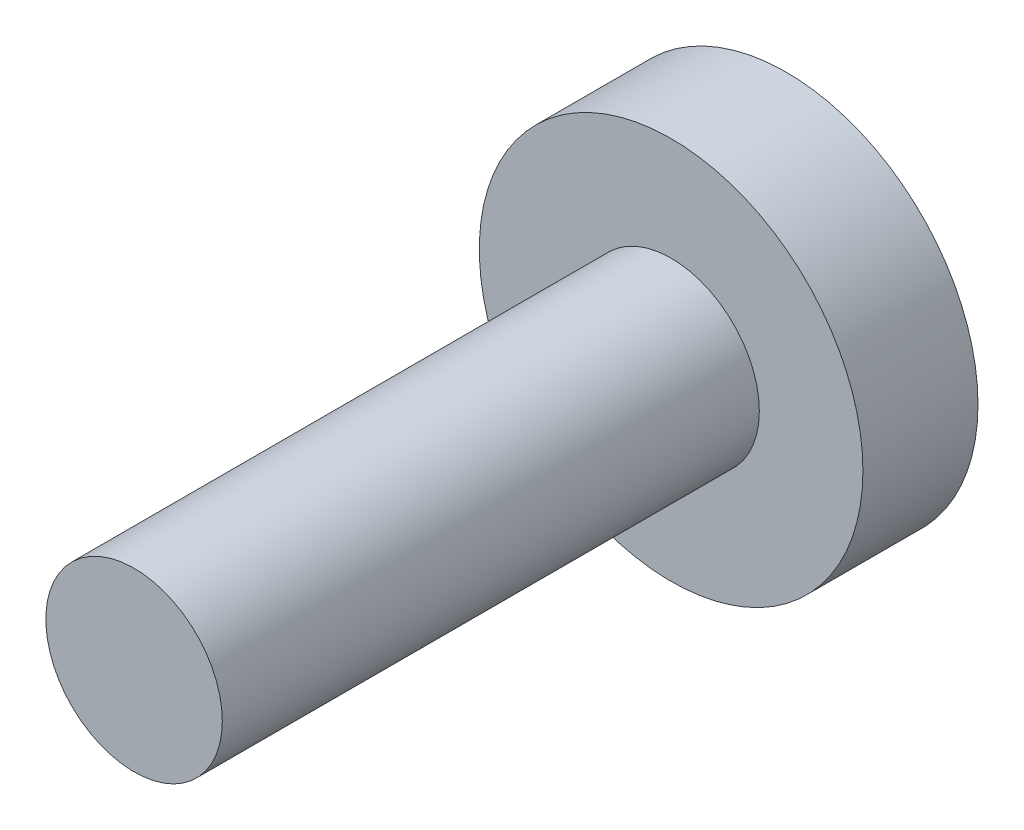
ISO-10303-21;
HEADER;
FILE_DESCRIPTION(('STEP AP214'),'2;1');
FILE_NAME('part.step','',(''),(''),'','','');
FILE_SCHEMA(('AUTOMOTIVE_DESIGN { 1 0 10303 214 1 1 1 1 }'));
ENDSEC;
DATA;
#1=APPLICATION_CONTEXT('core data for automotive mechanical design processes');
#2=APPLICATION_PROTOCOL_DEFINITION('international standard','automotive_design',2000,#1);
#3=PRODUCT_CONTEXT('',#1,'mechanical');
#4=PRODUCT('Part','Part','',(#3));
#5=PRODUCT_RELATED_PRODUCT_CATEGORY('part','',(#4));
#6=PRODUCT_DEFINITION_FORMATION('','',#4);
#7=PRODUCT_DEFINITION_CONTEXT('part definition',#1,'design');
#8=PRODUCT_DEFINITION('design','',#6,#7);
#9=PRODUCT_DEFINITION_SHAPE('','',#8);
#10=(LENGTH_UNIT() NAMED_UNIT(*) SI_UNIT(.MILLI.,.METRE.));
#11=(NAMED_UNIT(*) PLANE_ANGLE_UNIT() SI_UNIT($,.RADIAN.));
#12=(NAMED_UNIT(*) SI_UNIT($,.STERADIAN.) SOLID_ANGLE_UNIT());
#13=UNCERTAINTY_MEASURE_WITH_UNIT(LENGTH_MEASURE(1.E-05),#10,'distance_accuracy_value','');
#14=(GEOMETRIC_REPRESENTATION_CONTEXT(3) GLOBAL_UNCERTAINTY_ASSIGNED_CONTEXT((#13)) GLOBAL_UNIT_ASSIGNED_CONTEXT((#10,
#11,#12)) REPRESENTATION_CONTEXT('',''));
#15=CARTESIAN_POINT('',(0.,0.,0.));
#16=DIRECTION('',(0.,0.,1.));
#17=DIRECTION('',(1.,0.,0.));
#18=AXIS2_PLACEMENT_3D('',#15,#16,#17);
#19=CARTESIAN_POINT('',(0.,0.,17.78));
#20=DIRECTION('',(0.,0.,-1.));
#21=DIRECTION('',(-1.,0.,0.));
#22=AXIS2_PLACEMENT_3D('',#19,#20,#21);
#23=CYLINDRICAL_SURFACE('',#22,2.921);
#24=CARTESIAN_POINT('',(0.,0.,17.78));
#25=DIRECTION('',(0.,0.,1.));
#26=DIRECTION('',(1.,0.,0.));
#27=AXIS2_PLACEMENT_3D('',#24,#25,#26);
#28=CIRCLE('',#27,2.921);
#29=CARTESIAN_POINT('',(2.921,0.,17.78));
#30=VERTEX_POINT('',#29);
#31=EDGE_CURVE('E10',#30,#30,#28,.T.);
#32=ORIENTED_EDGE('',*,*,#31,.F.);
#33=EDGE_LOOP('',(#32));
#34=FACE_BOUND('',#33,.T.);
#35=CARTESIAN_POINT('',(0.,0.,0.));
#36=DIRECTION('',(0.,0.,1.));
#37=DIRECTION('',(1.,0.,0.));
#38=AXIS2_PLACEMENT_3D('',#35,#36,#37);
#39=CIRCLE('',#38,2.921);
#40=CARTESIAN_POINT('',(2.921,0.,0.));
#41=VERTEX_POINT('',#40);
#42=EDGE_CURVE('E34',#41,#41,#39,.T.);
#43=ORIENTED_EDGE('',*,*,#42,.T.);
#44=EDGE_LOOP('',(#43));
#45=FACE_BOUND('',#44,.T.);
#46=ADVANCED_FACE('F31',(#34,#45),#23,.T.);
#47=CARTESIAN_POINT('',(0.,0.,17.78));
#48=DIRECTION('',(0.,0.,1.));
#49=DIRECTION('',(1.,0.,0.));
#50=AXIS2_PLACEMENT_3D('',#47,#48,#49);
#51=PLANE('',#50);
#52=ORIENTED_EDGE('',*,*,#31,.T.);
#53=EDGE_LOOP('',(#52));
#54=FACE_BOUND('',#53,.T.);
#55=ADVANCED_FACE('F62',(#54),#51,.T.);
#56=CARTESIAN_POINT('',(0.,0.,-3.81));
#57=DIRECTION('',(0.,0.,1.));
#58=DIRECTION('',(1.,0.,0.));
#59=AXIS2_PLACEMENT_3D('',#56,#57,#58);
#60=CYLINDRICAL_SURFACE('',#59,6.35);
#61=CARTESIAN_POINT('',(0.,0.,-3.81));
#62=DIRECTION('',(0.,0.,1.));
#63=DIRECTION('',(1.,0.,0.));
#64=AXIS2_PLACEMENT_3D('',#61,#62,#63);
#65=CIRCLE('',#64,6.35);
#66=CARTESIAN_POINT('',(6.35,0.,-3.81));
#67=VERTEX_POINT('',#66);
#68=EDGE_CURVE('E41',#67,#67,#65,.T.);
#69=ORIENTED_EDGE('',*,*,#68,.T.);
#70=EDGE_LOOP('',(#69));
#71=FACE_BOUND('',#70,.T.);
#72=CARTESIAN_POINT('',(0.,0.,0.));
#73=DIRECTION('',(0.,0.,1.));
#74=DIRECTION('',(1.,0.,0.));
#75=AXIS2_PLACEMENT_3D('',#72,#73,#74);
#76=CIRCLE('',#75,6.35);
#77=CARTESIAN_POINT('',(6.35,0.,0.));
#78=VERTEX_POINT('',#77);
#79=EDGE_CURVE('E43',#78,#78,#76,.T.);
#80=ORIENTED_EDGE('',*,*,#79,.F.);
#81=EDGE_LOOP('',(#80));
#82=FACE_BOUND('',#81,.T.);
#83=ADVANCED_FACE('F49',(#71,#82),#60,.T.);
#84=CARTESIAN_POINT('',(0.,0.,-3.81));
#85=DIRECTION('',(0.,0.,1.));
#86=DIRECTION('',(1.,0.,0.));
#87=AXIS2_PLACEMENT_3D('',#84,#85,#86);
#88=PLANE('',#87);
#89=ORIENTED_EDGE('',*,*,#68,.F.);
#90=EDGE_LOOP('',(#89));
#91=FACE_BOUND('',#90,.T.);
#92=ADVANCED_FACE('F52',(#91),#88,.F.);
#93=CARTESIAN_POINT('',(0.,0.,0.));
#94=DIRECTION('',(0.,0.,1.));
#95=DIRECTION('',(1.,0.,0.));
#96=AXIS2_PLACEMENT_3D('',#93,#94,#95);
#97=PLANE('',#96);
#98=ORIENTED_EDGE('',*,*,#42,.F.);
#99=EDGE_LOOP('',(#98));
#100=FACE_BOUND('',#99,.T.);
#101=ORIENTED_EDGE('',*,*,#79,.T.);
#102=EDGE_LOOP('',(#101));
#103=FACE_BOUND('',#102,.T.);
#104=ADVANCED_FACE('F54',(#100,#103),#97,.T.);
#105=CLOSED_SHELL('',(#46,#55,#83,#92,#104));
#106=MANIFOLD_SOLID_BREP('B2',#105);
#107=ADVANCED_BREP_SHAPE_REPRESENTATION('',(#18,#106),#14);
#108=SHAPE_DEFINITION_REPRESENTATION(#9,#107);
ENDSEC;
END-ISO-10303-21;
